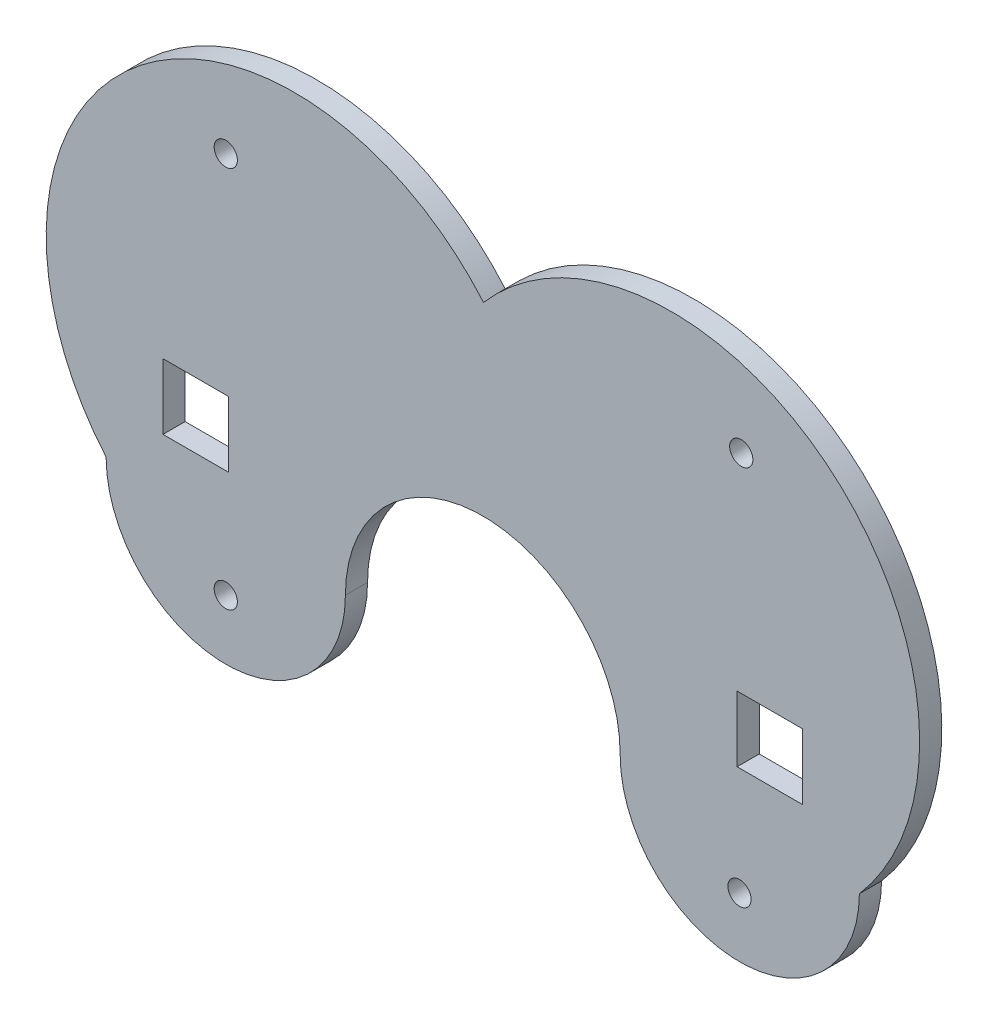
ISO-10303-21;
HEADER;
FILE_DESCRIPTION(('STEP AP214'),'2;1');
FILE_NAME('part.step','',(''),(''),'','','');
FILE_SCHEMA(('AUTOMOTIVE_DESIGN { 1 0 10303 214 1 1 1 1 }'));
ENDSEC;
DATA;
#1=APPLICATION_CONTEXT('core data for automotive mechanical design processes');
#2=APPLICATION_PROTOCOL_DEFINITION('international standard','automotive_design',2000,#1);
#3=PRODUCT_CONTEXT('',#1,'mechanical');
#4=PRODUCT('Part','Part','',(#3));
#5=PRODUCT_RELATED_PRODUCT_CATEGORY('part','',(#4));
#6=PRODUCT_DEFINITION_FORMATION('','',#4);
#7=PRODUCT_DEFINITION_CONTEXT('part definition',#1,'design');
#8=PRODUCT_DEFINITION('design','',#6,#7);
#9=PRODUCT_DEFINITION_SHAPE('','',#8);
#10=(LENGTH_UNIT() NAMED_UNIT(*) SI_UNIT(.MILLI.,.METRE.));
#11=(NAMED_UNIT(*) PLANE_ANGLE_UNIT() SI_UNIT($,.RADIAN.));
#12=(NAMED_UNIT(*) SI_UNIT($,.STERADIAN.) SOLID_ANGLE_UNIT());
#13=UNCERTAINTY_MEASURE_WITH_UNIT(LENGTH_MEASURE(1.E-05),#10,'distance_accuracy_value','');
#14=(GEOMETRIC_REPRESENTATION_CONTEXT(3) GLOBAL_UNCERTAINTY_ASSIGNED_CONTEXT((#13)) GLOBAL_UNIT_ASSIGNED_CONTEXT((#10,
#11,#12)) REPRESENTATION_CONTEXT('',''));
#15=CARTESIAN_POINT('',(0.,0.,0.));
#16=DIRECTION('',(0.,0.,1.));
#17=DIRECTION('',(1.,0.,0.));
#18=AXIS2_PLACEMENT_3D('',#15,#16,#17);
#19=CARTESIAN_POINT('',(26.986824348019,40.3224999999979,3.175));
#20=DIRECTION('',(0.,0.,-1.));
#21=DIRECTION('',(-1.,0.,0.));
#22=AXIS2_PLACEMENT_3D('',#19,#20,#21);
#23=CYLINDRICAL_SURFACE('',#22,35.5746838534342);
#24=CARTESIAN_POINT('',(26.986824348019,40.3224999999979,0.));
#25=DIRECTION('',(0.,0.,-1.));
#26=DIRECTION('',(-1.,0.,0.));
#27=AXIS2_PLACEMENT_3D('',#24,#25,#26);
#28=CIRCLE('',#27,35.5746838534342);
#29=CARTESIAN_POINT('',(-0.00135130395721023,17.145,0.));
#30=VERTEX_POINT('',#29);
#31=CARTESIAN_POINT('',(54.0809558360902,63.3760500558757,0.));
#32=VERTEX_POINT('',#31);
#33=EDGE_CURVE('E267',#30,#32,#28,.T.);
#34=ORIENTED_EDGE('',*,*,#33,.F.);
#35=DIRECTION('',(0.,0.,-1.));
#36=VECTOR('',#35,1.);
#37=CARTESIAN_POINT('',(-0.00135130395721023,17.145,3.175));
#38=LINE('',#37,#36);
#39=CARTESIAN_POINT('',(-0.00135130395721023,17.145,3.175));
#40=VERTEX_POINT('',#39);
#41=EDGE_CURVE('E12',#40,#30,#38,.T.);
#42=ORIENTED_EDGE('',*,*,#41,.F.);
#43=CARTESIAN_POINT('',(26.986824348019,40.3224999999979,3.175));
#44=DIRECTION('',(0.,0.,-1.));
#45=DIRECTION('',(-1.,0.,0.));
#46=AXIS2_PLACEMENT_3D('',#43,#44,#45);
#47=CIRCLE('',#46,35.5746838534342);
#48=CARTESIAN_POINT('',(54.0809558360902,63.3760500558757,3.175));
#49=VERTEX_POINT('',#48);
#50=EDGE_CURVE('E273',#40,#49,#47,.T.);
#51=ORIENTED_EDGE('',*,*,#50,.T.);
#52=DIRECTION('',(0.,0.,-1.));
#53=VECTOR('',#52,1.);
#54=CARTESIAN_POINT('',(54.0809558360902,63.3760500558757,3.175));
#55=LINE('',#54,#53);
#56=EDGE_CURVE('E44',#49,#32,#55,.T.);
#57=ORIENTED_EDGE('',*,*,#56,.T.);
#58=EDGE_LOOP('',(#34,#42,#51,#57));
#59=FACE_BOUND('',#58,.T.);
#60=ADVANCED_FACE('F41',(#59),#23,.T.);
#61=CARTESIAN_POINT('',(17.1436486960428,17.145,3.175));
#62=DIRECTION('',(0.,0.,-1.));
#63=DIRECTION('',(-1.,0.,0.));
#64=AXIS2_PLACEMENT_3D('',#61,#62,#63);
#65=CYLINDRICAL_SURFACE('',#64,17.145);
#66=CARTESIAN_POINT('',(17.1436486960428,17.145,0.));
#67=DIRECTION('',(0.,0.,-1.));
#68=DIRECTION('',(-1.,0.,0.));
#69=AXIS2_PLACEMENT_3D('',#66,#67,#68);
#70=CIRCLE('',#69,17.145);
#71=CARTESIAN_POINT('',(34.2886486960428,17.145,0.));
#72=VERTEX_POINT('',#71);
#73=EDGE_CURVE('E278',#72,#30,#70,.T.);
#74=ORIENTED_EDGE('',*,*,#73,.F.);
#75=DIRECTION('',(0.,0.,-1.));
#76=VECTOR('',#75,1.);
#77=CARTESIAN_POINT('',(34.2886486960428,17.145,3.175));
#78=LINE('',#77,#76);
#79=CARTESIAN_POINT('',(34.2886486960428,17.145,3.175));
#80=VERTEX_POINT('',#79);
#81=EDGE_CURVE('E50',#80,#72,#78,.T.);
#82=ORIENTED_EDGE('',*,*,#81,.F.);
#83=CARTESIAN_POINT('',(17.1436486960428,17.145,3.175));
#84=DIRECTION('',(0.,0.,-1.));
#85=DIRECTION('',(-1.,0.,0.));
#86=AXIS2_PLACEMENT_3D('',#83,#84,#85);
#87=CIRCLE('',#86,17.145);
#88=EDGE_CURVE('E288',#80,#40,#87,.T.);
#89=ORIENTED_EDGE('',*,*,#88,.T.);
#90=ORIENTED_EDGE('',*,*,#41,.T.);
#91=EDGE_LOOP('',(#74,#82,#89,#90));
#92=FACE_BOUND('',#91,.T.);
#93=ADVANCED_FACE('F333',(#92),#65,.T.);
#94=CARTESIAN_POINT('',(53.975,17.145,3.175));
#95=DIRECTION('',(0.,0.,-1.));
#96=DIRECTION('',(-1.,0.,0.));
#97=AXIS2_PLACEMENT_3D('',#94,#95,#96);
#98=CYLINDRICAL_SURFACE('',#97,19.6863513039572);
#99=CARTESIAN_POINT('',(53.975,17.145,0.));
#100=DIRECTION('',(0.,0.,-1.));
#101=DIRECTION('',(-1.,0.,0.));
#102=AXIS2_PLACEMENT_3D('',#99,#100,#101);
#103=CIRCLE('',#102,19.6863513039572);
#104=CARTESIAN_POINT('',(73.6612672503204,17.0874725128298,0.));
#105=VERTEX_POINT('',#104);
#106=EDGE_CURVE('E304',#72,#105,#103,.T.);
#107=ORIENTED_EDGE('',*,*,#106,.T.);
#108=DIRECTION('',(0.,0.,-1.));
#109=VECTOR('',#108,1.);
#110=CARTESIAN_POINT('',(73.6612672503204,17.0874725128298,3.175));
#111=LINE('',#110,#109);
#112=CARTESIAN_POINT('',(73.6612672503204,17.0874725128298,3.175));
#113=VERTEX_POINT('',#112);
#114=EDGE_CURVE('E313',#113,#105,#111,.T.);
#115=ORIENTED_EDGE('',*,*,#114,.F.);
#116=CARTESIAN_POINT('',(53.975,17.145,3.175));
#117=DIRECTION('',(0.,0.,-1.));
#118=DIRECTION('',(-1.,0.,0.));
#119=AXIS2_PLACEMENT_3D('',#116,#117,#118);
#120=CIRCLE('',#119,19.6863513039572);
#121=EDGE_CURVE('E285',#80,#113,#120,.T.);
#122=ORIENTED_EDGE('',*,*,#121,.F.);
#123=ORIENTED_EDGE('',*,*,#81,.T.);
#124=EDGE_LOOP('',(#107,#115,#122,#123));
#125=FACE_BOUND('',#124,.T.);
#126=ADVANCED_FACE('F385',(#125),#98,.F.);
#127=CARTESIAN_POINT('',(90.8058562194634,17.0373723536975,3.175));
#128=DIRECTION('',(0.,0.,-1.));
#129=DIRECTION('',(-1.,0.,0.));
#130=AXIS2_PLACEMENT_3D('',#127,#128,#129);
#131=CYLINDRICAL_SURFACE('',#130,17.1446621706818);
#132=CARTESIAN_POINT('',(90.8058562194634,17.0373723536975,0.));
#133=DIRECTION('',(0.,0.,1.));
#134=DIRECTION('',(1.,0.,0.));
#135=AXIS2_PLACEMENT_3D('',#132,#133,#134);
#136=CIRCLE('',#135,17.1446621706818);
#137=CARTESIAN_POINT('',(107.950180567484,16.9297452350518,0.));
#138=VERTEX_POINT('',#137);
#139=EDGE_CURVE('E300',#105,#138,#136,.T.);
#140=ORIENTED_EDGE('',*,*,#139,.T.);
#141=DIRECTION('',(0.,0.,-1.));
#142=VECTOR('',#141,1.);
#143=CARTESIAN_POINT('',(107.950180567484,16.9297452350518,3.175));
#144=LINE('',#143,#142);
#145=CARTESIAN_POINT('',(107.950180567484,16.9297452350518,3.175));
#146=VERTEX_POINT('',#145);
#147=EDGE_CURVE('E316',#146,#138,#144,.T.);
#148=ORIENTED_EDGE('',*,*,#147,.F.);
#149=CARTESIAN_POINT('',(90.8058562194634,17.0373723536975,3.175));
#150=DIRECTION('',(0.,0.,1.));
#151=DIRECTION('',(1.,0.,0.));
#152=AXIS2_PLACEMENT_3D('',#149,#150,#151);
#153=CIRCLE('',#152,17.1446621706818);
#154=EDGE_CURVE('E282',#113,#146,#153,.T.);
#155=ORIENTED_EDGE('',*,*,#154,.F.);
#156=ORIENTED_EDGE('',*,*,#114,.T.);
#157=EDGE_LOOP('',(#140,#148,#155,#156));
#158=FACE_BOUND('',#157,.T.);
#159=ADVANCED_FACE('F341',(#158),#131,.T.);
#160=CARTESIAN_POINT('',(81.0155682017876,40.1528976454641,3.175));
#161=DIRECTION('',(0.,0.,-1.));
#162=DIRECTION('',(-1.,0.,0.));
#163=AXIS2_PLACEMENT_3D('',#160,#161,#162);
#164=CYLINDRICAL_SURFACE('',#163,35.5638601837256);
#165=CARTESIAN_POINT('',(81.0155682017876,40.1528976454641,0.));
#166=DIRECTION('',(0.,0.,-1.));
#167=DIRECTION('',(-1.,0.,0.));
#168=AXIS2_PLACEMENT_3D('',#165,#166,#167);
#169=CIRCLE('',#168,35.5638601837256);
#170=EDGE_CURVE('E295',#32,#138,#169,.T.);
#171=ORIENTED_EDGE('',*,*,#170,.F.);
#172=ORIENTED_EDGE('',*,*,#56,.F.);
#173=CARTESIAN_POINT('',(81.0155682017876,40.1528976454641,3.175));
#174=DIRECTION('',(0.,0.,-1.));
#175=DIRECTION('',(-1.,0.,0.));
#176=AXIS2_PLACEMENT_3D('',#173,#174,#175);
#177=CIRCLE('',#176,35.5638601837256);
#178=EDGE_CURVE('E277',#49,#146,#177,.T.);
#179=ORIENTED_EDGE('',*,*,#178,.T.);
#180=ORIENTED_EDGE('',*,*,#147,.T.);
#181=EDGE_LOOP('',(#171,#172,#179,#180));
#182=FACE_BOUND('',#181,.T.);
#183=ADVANCED_FACE('F327',(#182),#164,.T.);
#184=CARTESIAN_POINT('',(54.0011962749033,40.237698822731,3.175));
#185=DIRECTION('',(0.,0.,-1.));
#186=DIRECTION('',(-1.,0.,0.));
#187=AXIS2_PLACEMENT_3D('',#184,#185,#186);
#188=PLANE('',#187);
#189=DIRECTION('',(-1.,0.,0.));
#190=VECTOR('',#189,1.);
#191=CARTESIAN_POINT('',(8.15139459531379,33.4327499999988,3.175));
#192=LINE('',#191,#190);
#193=CARTESIAN_POINT('',(17.5493945953138,33.4327499999988,3.175));
#194=VERTEX_POINT('',#193);
#195=CARTESIAN_POINT('',(8.15139459531379,33.4327499999988,3.175));
#196=VERTEX_POINT('',#195);
#197=EDGE_CURVE('E183',#194,#196,#192,.T.);
#198=ORIENTED_EDGE('',*,*,#197,.F.);
#199=DIRECTION('',(0.,1.,0.));
#200=VECTOR('',#199,1.);
#201=CARTESIAN_POINT('',(17.5493945953138,24.0347499999988,3.175));
#202=LINE('',#201,#200);
#203=CARTESIAN_POINT('',(17.5493945953138,24.0347499999988,3.175));
#204=VERTEX_POINT('',#203);
#205=EDGE_CURVE('E58',#204,#194,#202,.T.);
#206=ORIENTED_EDGE('',*,*,#205,.F.);
#207=DIRECTION('',(1.,0.,0.));
#208=VECTOR('',#207,1.);
#209=CARTESIAN_POINT('',(8.15139459531379,24.0347499999988,3.175));
#210=LINE('',#209,#208);
#211=CARTESIAN_POINT('',(8.15139459531379,24.0347499999988,3.175));
#212=VERTEX_POINT('',#211);
#213=EDGE_CURVE('E161',#212,#204,#210,.T.);
#214=ORIENTED_EDGE('',*,*,#213,.F.);
#215=DIRECTION('',(0.,-1.,0.));
#216=VECTOR('',#215,1.);
#217=CARTESIAN_POINT('',(8.15139459531379,24.0347499999988,3.175));
#218=LINE('',#217,#216);
#219=EDGE_CURVE('E165',#196,#212,#218,.T.);
#220=ORIENTED_EDGE('',*,*,#219,.F.);
#221=EDGE_LOOP('',(#198,#206,#214,#220));
#222=FACE_BOUND('',#221,.T.);
#223=DIRECTION('',(-1.,0.,0.));
#224=VECTOR('',#223,1.);
#225=CARTESIAN_POINT('',(90.4213478179168,33.3191850791469,3.175));
#226=LINE('',#225,#224);
#227=CARTESIAN_POINT('',(99.8193478179168,33.3191850791469,3.175));
#228=VERTEX_POINT('',#227);
#229=CARTESIAN_POINT('',(90.4213478179168,33.3191850791469,3.175));
#230=VERTEX_POINT('',#229);
#231=EDGE_CURVE('E225',#228,#230,#226,.T.);
#232=ORIENTED_EDGE('',*,*,#231,.F.);
#233=DIRECTION('',(0.,1.,0.));
#234=VECTOR('',#233,1.);
#235=CARTESIAN_POINT('',(99.8193478179168,23.9211850791469,3.175));
#236=LINE('',#235,#234);
#237=CARTESIAN_POINT('',(99.8193478179168,23.9211850791469,3.175));
#238=VERTEX_POINT('',#237);
#239=EDGE_CURVE('E66',#238,#228,#236,.T.);
#240=ORIENTED_EDGE('',*,*,#239,.F.);
#241=DIRECTION('',(1.,0.,0.));
#242=VECTOR('',#241,1.);
#243=CARTESIAN_POINT('',(90.4213478179168,23.9211850791469,3.175));
#244=LINE('',#243,#242);
#245=CARTESIAN_POINT('',(90.4213478179168,23.9211850791469,3.175));
#246=VERTEX_POINT('',#245);
#247=EDGE_CURVE('E205',#246,#238,#244,.T.);
#248=ORIENTED_EDGE('',*,*,#247,.F.);
#249=DIRECTION('',(0.,-1.,0.));
#250=VECTOR('',#249,1.);
#251=CARTESIAN_POINT('',(90.4213478179168,23.9211850791469,3.175));
#252=LINE('',#251,#250);
#253=EDGE_CURVE('E229',#230,#246,#252,.T.);
#254=ORIENTED_EDGE('',*,*,#253,.F.);
#255=EDGE_LOOP('',(#232,#240,#248,#254));
#256=FACE_BOUND('',#255,.T.);
#257=CARTESIAN_POINT('',(90.766339888859,8.43822518053674,3.175));
#258=DIRECTION('',(0.,0.,1.));
#259=DIRECTION('',(1.,0.,0.));
#260=AXIS2_PLACEMENT_3D('',#257,#258,#259);
#261=CIRCLE('',#260,1.66370000000001);
#262=CARTESIAN_POINT('',(92.430039888859,8.43822518053674,3.175));
#263=VERTEX_POINT('',#262);
#264=EDGE_CURVE('E346',#263,#263,#261,.T.);
#265=ORIENTED_EDGE('',*,*,#264,.F.);
#266=EDGE_LOOP('',(#265));
#267=FACE_BOUND('',#266,.T.);
#268=CARTESIAN_POINT('',(17.1436486960428,63.3760500558757,3.175));
#269=DIRECTION('',(0.,0.,1.));
#270=DIRECTION('',(1.,0.,0.));
#271=AXIS2_PLACEMENT_3D('',#268,#269,#270);
#272=CIRCLE('',#271,1.6637);
#273=CARTESIAN_POINT('',(18.8073486960428,63.3760500558757,3.175));
#274=VERTEX_POINT('',#273);
#275=EDGE_CURVE('E251',#274,#274,#272,.T.);
#276=ORIENTED_EDGE('',*,*,#275,.F.);
#277=EDGE_LOOP('',(#276));
#278=FACE_BOUND('',#277,.T.);
#279=CARTESIAN_POINT('',(91.0176382631337,63.1612244476696,3.175));
#280=DIRECTION('',(0.,0.,1.));
#281=DIRECTION('',(-1.,0.,0.));
#282=AXIS2_PLACEMENT_3D('',#279,#280,#281);
#283=CIRCLE('',#282,1.66370000000001);
#284=CARTESIAN_POINT('',(89.3539382631337,63.1612244476696,3.175));
#285=VERTEX_POINT('',#284);
#286=EDGE_CURVE('E193',#285,#285,#283,.T.);
#287=ORIENTED_EDGE('',*,*,#286,.F.);
#288=EDGE_LOOP('',(#287));
#289=FACE_BOUND('',#288,.T.);
#290=CARTESIAN_POINT('',(17.1436486960428,8.5725,3.175));
#291=DIRECTION('',(0.,0.,1.));
#292=DIRECTION('',(1.,0.,0.));
#293=AXIS2_PLACEMENT_3D('',#290,#291,#292);
#294=CIRCLE('',#293,1.6637);
#295=CARTESIAN_POINT('',(18.8073486960428,8.5725,3.175));
#296=VERTEX_POINT('',#295);
#297=EDGE_CURVE('E268',#296,#296,#294,.T.);
#298=ORIENTED_EDGE('',*,*,#297,.F.);
#299=EDGE_LOOP('',(#298));
#300=FACE_BOUND('',#299,.T.);
#301=ORIENTED_EDGE('',*,*,#50,.F.);
#302=ORIENTED_EDGE('',*,*,#88,.F.);
#303=ORIENTED_EDGE('',*,*,#121,.T.);
#304=ORIENTED_EDGE('',*,*,#154,.T.);
#305=ORIENTED_EDGE('',*,*,#178,.F.);
#306=EDGE_LOOP('',(#301,#302,#303,#304,#305));
#307=FACE_BOUND('',#306,.T.);
#308=ADVANCED_FACE('F337',(#222,#256,#267,#278,#289,#300,#307),#188,.F.);
#309=CARTESIAN_POINT('',(54.0011962749033,40.237698822731,0.));
#310=DIRECTION('',(0.,0.,-1.));
#311=DIRECTION('',(-1.,0.,0.));
#312=AXIS2_PLACEMENT_3D('',#309,#310,#311);
#313=PLANE('',#312);
#314=DIRECTION('',(0.,1.,0.));
#315=VECTOR('',#314,1.);
#316=CARTESIAN_POINT('',(17.5493945953138,24.0347499999988,0.));
#317=LINE('',#316,#315);
#318=CARTESIAN_POINT('',(17.5493945953138,24.0347499999988,0.));
#319=VERTEX_POINT('',#318);
#320=CARTESIAN_POINT('',(17.5493945953138,33.4327499999988,0.));
#321=VERTEX_POINT('',#320);
#322=EDGE_CURVE('E139',#319,#321,#317,.T.);
#323=ORIENTED_EDGE('',*,*,#322,.T.);
#324=DIRECTION('',(-1.,0.,0.));
#325=VECTOR('',#324,1.);
#326=CARTESIAN_POINT('',(8.15139459531379,33.4327499999988,0.));
#327=LINE('',#326,#325);
#328=CARTESIAN_POINT('',(8.15139459531379,33.4327499999988,0.));
#329=VERTEX_POINT('',#328);
#330=EDGE_CURVE('E150',#321,#329,#327,.T.);
#331=ORIENTED_EDGE('',*,*,#330,.T.);
#332=DIRECTION('',(0.,-1.,0.));
#333=VECTOR('',#332,1.);
#334=CARTESIAN_POINT('',(8.15139459531379,24.0347499999988,0.));
#335=LINE('',#334,#333);
#336=CARTESIAN_POINT('',(8.15139459531379,24.0347499999988,0.));
#337=VERTEX_POINT('',#336);
#338=EDGE_CURVE('E155',#329,#337,#335,.T.);
#339=ORIENTED_EDGE('',*,*,#338,.T.);
#340=DIRECTION('',(1.,0.,0.));
#341=VECTOR('',#340,1.);
#342=CARTESIAN_POINT('',(8.15139459531379,24.0347499999988,0.));
#343=LINE('',#342,#341);
#344=EDGE_CURVE('E146',#337,#319,#343,.T.);
#345=ORIENTED_EDGE('',*,*,#344,.T.);
#346=EDGE_LOOP('',(#323,#331,#339,#345));
#347=FACE_BOUND('',#346,.T.);
#348=DIRECTION('',(0.,1.,0.));
#349=VECTOR('',#348,1.);
#350=CARTESIAN_POINT('',(99.8193478179168,23.9211850791469,0.));
#351=LINE('',#350,#349);
#352=CARTESIAN_POINT('',(99.8193478179168,23.9211850791469,0.));
#353=VERTEX_POINT('',#352);
#354=CARTESIAN_POINT('',(99.8193478179168,33.3191850791469,0.));
#355=VERTEX_POINT('',#354);
#356=EDGE_CURVE('E199',#353,#355,#351,.T.);
#357=ORIENTED_EDGE('',*,*,#356,.T.);
#358=DIRECTION('',(-1.,0.,0.));
#359=VECTOR('',#358,1.);
#360=CARTESIAN_POINT('',(90.4213478179168,33.3191850791469,0.));
#361=LINE('',#360,#359);
#362=CARTESIAN_POINT('',(90.4213478179168,33.3191850791469,0.));
#363=VERTEX_POINT('',#362);
#364=EDGE_CURVE('E204',#355,#363,#361,.T.);
#365=ORIENTED_EDGE('',*,*,#364,.T.);
#366=DIRECTION('',(0.,-1.,0.));
#367=VECTOR('',#366,1.);
#368=CARTESIAN_POINT('',(90.4213478179168,23.9211850791469,0.));
#369=LINE('',#368,#367);
#370=CARTESIAN_POINT('',(90.4213478179168,23.9211850791469,0.));
#371=VERTEX_POINT('',#370);
#372=EDGE_CURVE('E213',#363,#371,#369,.T.);
#373=ORIENTED_EDGE('',*,*,#372,.T.);
#374=DIRECTION('',(1.,0.,0.));
#375=VECTOR('',#374,1.);
#376=CARTESIAN_POINT('',(90.4213478179168,23.9211850791469,0.));
#377=LINE('',#376,#375);
#378=EDGE_CURVE('E217',#371,#353,#377,.T.);
#379=ORIENTED_EDGE('',*,*,#378,.T.);
#380=EDGE_LOOP('',(#357,#365,#373,#379));
#381=FACE_BOUND('',#380,.T.);
#382=CARTESIAN_POINT('',(90.766339888859,8.43822518053674,0.));
#383=DIRECTION('',(0.,0.,1.));
#384=DIRECTION('',(1.,0.,0.));
#385=AXIS2_PLACEMENT_3D('',#382,#383,#384);
#386=CIRCLE('',#385,1.66370000000001);
#387=CARTESIAN_POINT('',(92.430039888859,8.43822518053674,0.));
#388=VERTEX_POINT('',#387);
#389=EDGE_CURVE('E272',#388,#388,#386,.T.);
#390=ORIENTED_EDGE('',*,*,#389,.T.);
#391=EDGE_LOOP('',(#390));
#392=FACE_BOUND('',#391,.T.);
#393=CARTESIAN_POINT('',(17.1436486960428,63.3760500558757,0.));
#394=DIRECTION('',(0.,0.,1.));
#395=DIRECTION('',(1.,0.,0.));
#396=AXIS2_PLACEMENT_3D('',#393,#394,#395);
#397=CIRCLE('',#396,1.6637);
#398=CARTESIAN_POINT('',(18.8073486960428,63.3760500558757,0.));
#399=VERTEX_POINT('',#398);
#400=EDGE_CURVE('E349',#399,#399,#397,.T.);
#401=ORIENTED_EDGE('',*,*,#400,.T.);
#402=EDGE_LOOP('',(#401));
#403=FACE_BOUND('',#402,.T.);
#404=CARTESIAN_POINT('',(91.0176382631337,63.1612244476696,0.));
#405=DIRECTION('',(0.,0.,1.));
#406=DIRECTION('',(-1.,0.,0.));
#407=AXIS2_PLACEMENT_3D('',#404,#405,#406);
#408=CIRCLE('',#407,1.66370000000001);
#409=CARTESIAN_POINT('',(89.3539382631337,63.1612244476696,0.));
#410=VERTEX_POINT('',#409);
#411=EDGE_CURVE('E246',#410,#410,#408,.T.);
#412=ORIENTED_EDGE('',*,*,#411,.T.);
#413=EDGE_LOOP('',(#412));
#414=FACE_BOUND('',#413,.T.);
#415=CARTESIAN_POINT('',(17.1436486960428,8.5725,0.));
#416=DIRECTION('',(0.,0.,1.));
#417=DIRECTION('',(1.,0.,0.));
#418=AXIS2_PLACEMENT_3D('',#415,#416,#417);
#419=CIRCLE('',#418,1.6637);
#420=CARTESIAN_POINT('',(18.8073486960428,8.5725,0.));
#421=VERTEX_POINT('',#420);
#422=EDGE_CURVE('E261',#421,#421,#419,.T.);
#423=ORIENTED_EDGE('',*,*,#422,.T.);
#424=EDGE_LOOP('',(#423));
#425=FACE_BOUND('',#424,.T.);
#426=ORIENTED_EDGE('',*,*,#33,.T.);
#427=ORIENTED_EDGE('',*,*,#170,.T.);
#428=ORIENTED_EDGE('',*,*,#139,.F.);
#429=ORIENTED_EDGE('',*,*,#106,.F.);
#430=ORIENTED_EDGE('',*,*,#73,.T.);
#431=EDGE_LOOP('',(#426,#427,#428,#429,#430));
#432=FACE_BOUND('',#431,.T.);
#433=ADVANCED_FACE('F157',(#347,#381,#392,#403,#414,#425,#432),#313,.T.);
#434=CARTESIAN_POINT('',(17.1436486960428,8.5725,0.));
#435=DIRECTION('',(0.,0.,1.));
#436=DIRECTION('',(1.,0.,0.));
#437=AXIS2_PLACEMENT_3D('',#434,#435,#436);
#438=CYLINDRICAL_SURFACE('',#437,1.6637);
#439=ORIENTED_EDGE('',*,*,#422,.F.);
#440=EDGE_LOOP('',(#439));
#441=FACE_BOUND('',#440,.T.);
#442=ORIENTED_EDGE('',*,*,#297,.T.);
#443=EDGE_LOOP('',(#442));
#444=FACE_BOUND('',#443,.T.);
#445=ADVANCED_FACE('F366',(#441,#444),#438,.F.);
#446=CARTESIAN_POINT('',(91.0176382631337,63.1612244476696,0.));
#447=DIRECTION('',(0.,0.,1.));
#448=DIRECTION('',(1.,0.,0.));
#449=AXIS2_PLACEMENT_3D('',#446,#447,#448);
#450=CYLINDRICAL_SURFACE('',#449,1.66370000000001);
#451=ORIENTED_EDGE('',*,*,#411,.F.);
#452=EDGE_LOOP('',(#451));
#453=FACE_BOUND('',#452,.T.);
#454=ORIENTED_EDGE('',*,*,#286,.T.);
#455=EDGE_LOOP('',(#454));
#456=FACE_BOUND('',#455,.T.);
#457=ADVANCED_FACE('F358',(#453,#456),#450,.F.);
#458=CARTESIAN_POINT('',(17.1436486960428,63.3760500558757,0.));
#459=DIRECTION('',(0.,0.,1.));
#460=DIRECTION('',(1.,0.,0.));
#461=AXIS2_PLACEMENT_3D('',#458,#459,#460);
#462=CYLINDRICAL_SURFACE('',#461,1.6637);
#463=ORIENTED_EDGE('',*,*,#400,.F.);
#464=EDGE_LOOP('',(#463));
#465=FACE_BOUND('',#464,.T.);
#466=ORIENTED_EDGE('',*,*,#275,.T.);
#467=EDGE_LOOP('',(#466));
#468=FACE_BOUND('',#467,.T.);
#469=ADVANCED_FACE('F374',(#465,#468),#462,.F.);
#470=CARTESIAN_POINT('',(90.766339888859,8.43822518053674,0.));
#471=DIRECTION('',(0.,0.,1.));
#472=DIRECTION('',(1.,0.,0.));
#473=AXIS2_PLACEMENT_3D('',#470,#471,#472);
#474=CYLINDRICAL_SURFACE('',#473,1.66370000000001);
#475=ORIENTED_EDGE('',*,*,#389,.F.);
#476=EDGE_LOOP('',(#475));
#477=FACE_BOUND('',#476,.T.);
#478=ORIENTED_EDGE('',*,*,#264,.T.);
#479=EDGE_LOOP('',(#478));
#480=FACE_BOUND('',#479,.T.);
#481=ADVANCED_FACE('F421',(#477,#480),#474,.F.);
#482=CARTESIAN_POINT('',(99.8193478179168,23.9211850791469,0.));
#483=DIRECTION('',(1.,0.,0.));
#484=DIRECTION('',(0.,0.,-1.));
#485=AXIS2_PLACEMENT_3D('',#482,#483,#484);
#486=PLANE('',#485);
#487=ORIENTED_EDGE('',*,*,#239,.T.);
#488=DIRECTION('',(0.,0.,1.));
#489=VECTOR('',#488,1.);
#490=CARTESIAN_POINT('',(99.8193478179168,33.3191850791469,0.));
#491=LINE('',#490,#489);
#492=EDGE_CURVE('E222',#355,#228,#491,.T.);
#493=ORIENTED_EDGE('',*,*,#492,.F.);
#494=ORIENTED_EDGE('',*,*,#356,.F.);
#495=DIRECTION('',(0.,0.,1.));
#496=VECTOR('',#495,1.);
#497=CARTESIAN_POINT('',(99.8193478179168,23.9211850791469,0.));
#498=LINE('',#497,#496);
#499=EDGE_CURVE('E184',#353,#238,#498,.T.);
#500=ORIENTED_EDGE('',*,*,#499,.T.);
#501=EDGE_LOOP('',(#487,#493,#494,#500));
#502=FACE_BOUND('',#501,.T.);
#503=ADVANCED_FACE('F415',(#502),#486,.F.);
#504=CARTESIAN_POINT('',(90.4213478179168,23.9211850791469,0.));
#505=DIRECTION('',(0.,-1.,0.));
#506=DIRECTION('',(0.,0.,-1.));
#507=AXIS2_PLACEMENT_3D('',#504,#505,#506);
#508=PLANE('',#507);
#509=ORIENTED_EDGE('',*,*,#247,.T.);
#510=ORIENTED_EDGE('',*,*,#499,.F.);
#511=ORIENTED_EDGE('',*,*,#378,.F.);
#512=DIRECTION('',(0.,0.,1.));
#513=VECTOR('',#512,1.);
#514=CARTESIAN_POINT('',(90.4213478179168,23.9211850791469,0.));
#515=LINE('',#514,#513);
#516=EDGE_CURVE('E238',#371,#246,#515,.T.);
#517=ORIENTED_EDGE('',*,*,#516,.T.);
#518=EDGE_LOOP('',(#509,#510,#511,#517));
#519=FACE_BOUND('',#518,.T.);
#520=ADVANCED_FACE('F420',(#519),#508,.F.);
#521=CARTESIAN_POINT('',(90.4213478179168,23.9211850791469,0.));
#522=DIRECTION('',(-1.,0.,0.));
#523=DIRECTION('',(0.,0.,1.));
#524=AXIS2_PLACEMENT_3D('',#521,#522,#523);
#525=PLANE('',#524);
#526=ORIENTED_EDGE('',*,*,#253,.T.);
#527=ORIENTED_EDGE('',*,*,#516,.F.);
#528=ORIENTED_EDGE('',*,*,#372,.F.);
#529=DIRECTION('',(0.,0.,1.));
#530=VECTOR('',#529,1.);
#531=CARTESIAN_POINT('',(90.4213478179168,33.3191850791469,0.));
#532=LINE('',#531,#530);
#533=EDGE_CURVE('E241',#363,#230,#532,.T.);
#534=ORIENTED_EDGE('',*,*,#533,.T.);
#535=EDGE_LOOP('',(#526,#527,#528,#534));
#536=FACE_BOUND('',#535,.T.);
#537=ADVANCED_FACE('F432',(#536),#525,.F.);
#538=CARTESIAN_POINT('',(90.4213478179168,33.3191850791469,0.));
#539=DIRECTION('',(0.,1.,0.));
#540=DIRECTION('',(0.,0.,1.));
#541=AXIS2_PLACEMENT_3D('',#538,#539,#540);
#542=PLANE('',#541);
#543=ORIENTED_EDGE('',*,*,#231,.T.);
#544=ORIENTED_EDGE('',*,*,#533,.F.);
#545=ORIENTED_EDGE('',*,*,#364,.F.);
#546=ORIENTED_EDGE('',*,*,#492,.T.);
#547=EDGE_LOOP('',(#543,#544,#545,#546));
#548=FACE_BOUND('',#547,.T.);
#549=ADVANCED_FACE('F442',(#548),#542,.F.);
#550=CARTESIAN_POINT('',(17.5493945953138,24.0347499999988,0.));
#551=DIRECTION('',(1.,0.,0.));
#552=DIRECTION('',(0.,0.,-1.));
#553=AXIS2_PLACEMENT_3D('',#550,#551,#552);
#554=PLANE('',#553);
#555=ORIENTED_EDGE('',*,*,#205,.T.);
#556=DIRECTION('',(0.,0.,1.));
#557=VECTOR('',#556,1.);
#558=CARTESIAN_POINT('',(17.5493945953138,33.4327499999988,0.));
#559=LINE('',#558,#557);
#560=EDGE_CURVE('E135',#321,#194,#559,.T.);
#561=ORIENTED_EDGE('',*,*,#560,.F.);
#562=ORIENTED_EDGE('',*,*,#322,.F.);
#563=DIRECTION('',(0.,0.,1.));
#564=VECTOR('',#563,1.);
#565=CARTESIAN_POINT('',(17.5493945953138,24.0347499999988,0.));
#566=LINE('',#565,#564);
#567=EDGE_CURVE('E190',#319,#204,#566,.T.);
#568=ORIENTED_EDGE('',*,*,#567,.T.);
#569=EDGE_LOOP('',(#555,#561,#562,#568));
#570=FACE_BOUND('',#569,.T.);
#571=ADVANCED_FACE('F137',(#570),#554,.F.);
#572=CARTESIAN_POINT('',(8.15139459531379,24.0347499999988,0.));
#573=DIRECTION('',(0.,-1.,0.));
#574=DIRECTION('',(0.,0.,-1.));
#575=AXIS2_PLACEMENT_3D('',#572,#573,#574);
#576=PLANE('',#575);
#577=ORIENTED_EDGE('',*,*,#213,.T.);
#578=ORIENTED_EDGE('',*,*,#567,.F.);
#579=ORIENTED_EDGE('',*,*,#344,.F.);
#580=DIRECTION('',(0.,0.,1.));
#581=VECTOR('',#580,1.);
#582=CARTESIAN_POINT('',(8.15139459531379,24.0347499999988,0.));
#583=LINE('',#582,#581);
#584=EDGE_CURVE('E194',#337,#212,#583,.T.);
#585=ORIENTED_EDGE('',*,*,#584,.T.);
#586=EDGE_LOOP('',(#577,#578,#579,#585));
#587=FACE_BOUND('',#586,.T.);
#588=ADVANCED_FACE('F461',(#587),#576,.F.);
#589=CARTESIAN_POINT('',(8.15139459531379,24.0347499999988,0.));
#590=DIRECTION('',(-1.,0.,0.));
#591=DIRECTION('',(0.,0.,1.));
#592=AXIS2_PLACEMENT_3D('',#589,#590,#591);
#593=PLANE('',#592);
#594=ORIENTED_EDGE('',*,*,#219,.T.);
#595=ORIENTED_EDGE('',*,*,#584,.F.);
#596=ORIENTED_EDGE('',*,*,#338,.F.);
#597=DIRECTION('',(0.,0.,1.));
#598=VECTOR('',#597,1.);
#599=CARTESIAN_POINT('',(8.15139459531379,33.4327499999988,0.));
#600=LINE('',#599,#598);
#601=EDGE_CURVE('E145',#329,#196,#600,.T.);
#602=ORIENTED_EDGE('',*,*,#601,.T.);
#603=EDGE_LOOP('',(#594,#595,#596,#602));
#604=FACE_BOUND('',#603,.T.);
#605=ADVANCED_FACE('F470',(#604),#593,.F.);
#606=CARTESIAN_POINT('',(8.15139459531379,33.4327499999988,0.));
#607=DIRECTION('',(0.,1.,0.));
#608=DIRECTION('',(0.,0.,1.));
#609=AXIS2_PLACEMENT_3D('',#606,#607,#608);
#610=PLANE('',#609);
#611=ORIENTED_EDGE('',*,*,#197,.T.);
#612=ORIENTED_EDGE('',*,*,#601,.F.);
#613=ORIENTED_EDGE('',*,*,#330,.F.);
#614=ORIENTED_EDGE('',*,*,#560,.T.);
#615=EDGE_LOOP('',(#611,#612,#613,#614));
#616=FACE_BOUND('',#615,.T.);
#617=ADVANCED_FACE('F151',(#616),#610,.F.);
#618=CLOSED_SHELL('',(#60,#93,#126,#159,#183,#308,#433,#445,#457,#469,#481,#503,#520,#537,#549,
#571,#588,#605,#617));
#619=MANIFOLD_SOLID_BREP('B2',#618);
#620=ADVANCED_BREP_SHAPE_REPRESENTATION('',(#18,#619),#14);
#621=SHAPE_DEFINITION_REPRESENTATION(#9,#620);
ENDSEC;
END-ISO-10303-21;
